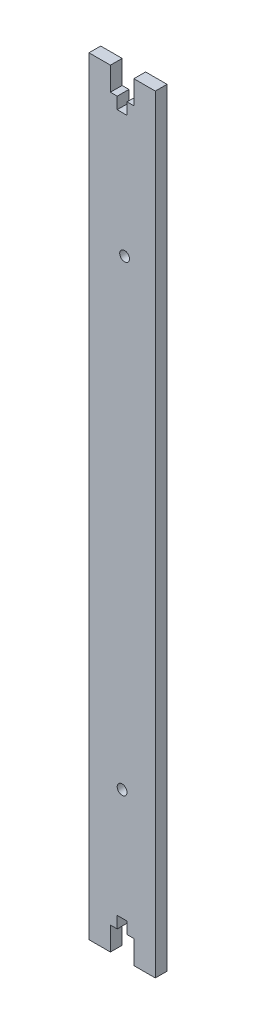
ISO-10303-21;
HEADER;
FILE_DESCRIPTION(('STEP AP214'),'2;1');
FILE_NAME('part.step','',(''),(''),'','','');
FILE_SCHEMA(('AUTOMOTIVE_DESIGN { 1 0 10303 214 1 1 1 1 }'));
ENDSEC;
DATA;
#1=APPLICATION_CONTEXT('core data for automotive mechanical design processes');
#2=APPLICATION_PROTOCOL_DEFINITION('international standard','automotive_design',2000,#1);
#3=PRODUCT_CONTEXT('',#1,'mechanical');
#4=PRODUCT('Part','Part','',(#3));
#5=PRODUCT_RELATED_PRODUCT_CATEGORY('part','',(#4));
#6=PRODUCT_DEFINITION_FORMATION('','',#4);
#7=PRODUCT_DEFINITION_CONTEXT('part definition',#1,'design');
#8=PRODUCT_DEFINITION('design','',#6,#7);
#9=PRODUCT_DEFINITION_SHAPE('','',#8);
#10=(LENGTH_UNIT() NAMED_UNIT(*) SI_UNIT(.MILLI.,.METRE.));
#11=(NAMED_UNIT(*) PLANE_ANGLE_UNIT() SI_UNIT($,.RADIAN.));
#12=(NAMED_UNIT(*) SI_UNIT($,.STERADIAN.) SOLID_ANGLE_UNIT());
#13=UNCERTAINTY_MEASURE_WITH_UNIT(LENGTH_MEASURE(1.E-05),#10,'distance_accuracy_value','');
#14=(GEOMETRIC_REPRESENTATION_CONTEXT(3) GLOBAL_UNCERTAINTY_ASSIGNED_CONTEXT((#13)) GLOBAL_UNIT_ASSIGNED_CONTEXT((#10,
#11,#12)) REPRESENTATION_CONTEXT('',''));
#15=CARTESIAN_POINT('',(0.,0.,0.));
#16=DIRECTION('',(0.,0.,1.));
#17=DIRECTION('',(1.,0.,0.));
#18=AXIS2_PLACEMENT_3D('',#15,#16,#17);
#19=CARTESIAN_POINT('',(-14.14,163.75,5.));
#20=DIRECTION('',(0.,-1.,0.));
#21=DIRECTION('',(0.,0.,-1.));
#22=AXIS2_PLACEMENT_3D('',#19,#20,#21);
#23=PLANE('',#22);
#24=DIRECTION('',(-1.,0.,0.));
#25=VECTOR('',#24,1.);
#26=CARTESIAN_POINT('',(-14.14,163.75,0.));
#27=LINE('',#26,#25);
#28=CARTESIAN_POINT('',(14.14,163.75,0.));
#29=VERTEX_POINT('',#28);
#30=CARTESIAN_POINT('',(5.,163.75,0.));
#31=VERTEX_POINT('',#30);
#32=EDGE_CURVE('E217',#29,#31,#27,.T.);
#33=ORIENTED_EDGE('',*,*,#32,.T.);
#34=DIRECTION('',(0.,0.,1.));
#35=VECTOR('',#34,1.);
#36=CARTESIAN_POINT('',(5.,163.75,-5.));
#37=LINE('',#36,#35);
#38=CARTESIAN_POINT('',(5.,163.75,5.));
#39=VERTEX_POINT('',#38);
#40=EDGE_CURVE('E237',#31,#39,#37,.T.);
#41=ORIENTED_EDGE('',*,*,#40,.T.);
#42=DIRECTION('',(-1.,0.,0.));
#43=VECTOR('',#42,1.);
#44=CARTESIAN_POINT('',(-14.14,163.75,5.));
#45=LINE('',#44,#43);
#46=CARTESIAN_POINT('',(14.14,163.75,5.));
#47=VERTEX_POINT('',#46);
#48=EDGE_CURVE('E196',#47,#39,#45,.T.);
#49=ORIENTED_EDGE('',*,*,#48,.F.);
#50=DIRECTION('',(0.,0.,-1.));
#51=VECTOR('',#50,1.);
#52=CARTESIAN_POINT('',(14.14,163.75,5.));
#53=LINE('',#52,#51);
#54=EDGE_CURVE('E231',#47,#29,#53,.T.);
#55=ORIENTED_EDGE('',*,*,#54,.T.);
#56=EDGE_LOOP('',(#33,#41,#49,#55));
#57=FACE_BOUND('',#56,.T.);
#58=ADVANCED_FACE('F33',(#57),#23,.F.);
#59=CARTESIAN_POINT('',(-14.14,-163.75,5.));
#60=DIRECTION('',(0.,1.,0.));
#61=DIRECTION('',(0.,0.,1.));
#62=AXIS2_PLACEMENT_3D('',#59,#60,#61);
#63=PLANE('',#62);
#64=DIRECTION('',(1.,0.,0.));
#65=VECTOR('',#64,1.);
#66=CARTESIAN_POINT('',(-14.14,-163.75,5.));
#67=LINE('',#66,#65);
#68=CARTESIAN_POINT('',(5.,-163.75,5.));
#69=VERTEX_POINT('',#68);
#70=CARTESIAN_POINT('',(14.14,-163.75,5.));
#71=VERTEX_POINT('',#70);
#72=EDGE_CURVE('E207',#69,#71,#67,.T.);
#73=ORIENTED_EDGE('',*,*,#72,.F.);
#74=DIRECTION('',(0.,0.,1.));
#75=VECTOR('',#74,1.);
#76=CARTESIAN_POINT('',(5.,-163.75,-5.));
#77=LINE('',#76,#75);
#78=CARTESIAN_POINT('',(5.,-163.75,0.));
#79=VERTEX_POINT('',#78);
#80=EDGE_CURVE('E324',#79,#69,#77,.T.);
#81=ORIENTED_EDGE('',*,*,#80,.F.);
#82=DIRECTION('',(1.,0.,0.));
#83=VECTOR('',#82,1.);
#84=CARTESIAN_POINT('',(-14.14,-163.75,0.));
#85=LINE('',#84,#83);
#86=CARTESIAN_POINT('',(14.14,-163.75,0.));
#87=VERTEX_POINT('',#86);
#88=EDGE_CURVE('E222',#79,#87,#85,.T.);
#89=ORIENTED_EDGE('',*,*,#88,.T.);
#90=DIRECTION('',(0.,0.,-1.));
#91=VECTOR('',#90,1.);
#92=CARTESIAN_POINT('',(14.14,-163.75,5.));
#93=LINE('',#92,#91);
#94=EDGE_CURVE('E211',#71,#87,#93,.T.);
#95=ORIENTED_EDGE('',*,*,#94,.F.);
#96=EDGE_LOOP('',(#73,#81,#89,#95));
#97=FACE_BOUND('',#96,.T.);
#98=ADVANCED_FACE('F369',(#97),#63,.F.);
#99=CARTESIAN_POINT('',(14.14,163.75,5.));
#100=DIRECTION('',(-1.,0.,0.));
#101=DIRECTION('',(0.,-1.,0.));
#102=AXIS2_PLACEMENT_3D('',#99,#100,#101);
#103=PLANE('',#102);
#104=DIRECTION('',(0.,1.,0.));
#105=VECTOR('',#104,1.);
#106=CARTESIAN_POINT('',(14.14,163.75,0.));
#107=LINE('',#106,#105);
#108=EDGE_CURVE('E212',#87,#29,#107,.T.);
#109=ORIENTED_EDGE('',*,*,#108,.T.);
#110=ORIENTED_EDGE('',*,*,#54,.F.);
#111=DIRECTION('',(0.,1.,0.));
#112=VECTOR('',#111,1.);
#113=CARTESIAN_POINT('',(14.14,163.75,5.));
#114=LINE('',#113,#112);
#115=EDGE_CURVE('E197',#71,#47,#114,.T.);
#116=ORIENTED_EDGE('',*,*,#115,.F.);
#117=ORIENTED_EDGE('',*,*,#94,.T.);
#118=EDGE_LOOP('',(#109,#110,#116,#117));
#119=FACE_BOUND('',#118,.T.);
#120=ADVANCED_FACE('F35',(#119),#103,.F.);
#121=CARTESIAN_POINT('',(-5.00000000000003,163.75,5.));
#122=VERTEX_POINT('',#121);
#123=CARTESIAN_POINT('',(-14.14,163.75,5.));
#124=VERTEX_POINT('',#123);
#125=EDGE_CURVE('E185',#122,#124,#45,.T.);
#126=ORIENTED_EDGE('',*,*,#125,.F.);
#127=DIRECTION('',(0.,0.,1.));
#128=VECTOR('',#127,1.);
#129=CARTESIAN_POINT('',(-5.00000000000003,163.75,-5.));
#130=LINE('',#129,#128);
#131=CARTESIAN_POINT('',(-5.00000000000003,163.75,0.));
#132=VERTEX_POINT('',#131);
#133=EDGE_CURVE('E169',#132,#122,#130,.T.);
#134=ORIENTED_EDGE('',*,*,#133,.F.);
#135=CARTESIAN_POINT('',(-14.14,163.75,0.));
#136=VERTEX_POINT('',#135);
#137=EDGE_CURVE('E215',#132,#136,#27,.T.);
#138=ORIENTED_EDGE('',*,*,#137,.T.);
#139=DIRECTION('',(0.,0.,-1.));
#140=VECTOR('',#139,1.);
#141=CARTESIAN_POINT('',(-14.14,163.75,5.));
#142=LINE('',#141,#140);
#143=EDGE_CURVE('E194',#124,#136,#142,.T.);
#144=ORIENTED_EDGE('',*,*,#143,.F.);
#145=EDGE_LOOP('',(#126,#134,#138,#144));
#146=FACE_BOUND('',#145,.T.);
#147=ADVANCED_FACE('F192',(#146),#23,.F.);
#148=CARTESIAN_POINT('',(-14.14,163.75,5.));
#149=DIRECTION('',(1.,0.,0.));
#150=DIRECTION('',(0.,1.,0.));
#151=AXIS2_PLACEMENT_3D('',#148,#149,#150);
#152=PLANE('',#151);
#153=DIRECTION('',(0.,-1.,0.));
#154=VECTOR('',#153,1.);
#155=CARTESIAN_POINT('',(-14.14,163.75,0.));
#156=LINE('',#155,#154);
#157=CARTESIAN_POINT('',(-14.14,-163.75,0.));
#158=VERTEX_POINT('',#157);
#159=EDGE_CURVE('E220',#136,#158,#156,.T.);
#160=ORIENTED_EDGE('',*,*,#159,.T.);
#161=DIRECTION('',(0.,0.,-1.));
#162=VECTOR('',#161,1.);
#163=CARTESIAN_POINT('',(-14.14,-163.75,5.));
#164=LINE('',#163,#162);
#165=CARTESIAN_POINT('',(-14.14,-163.75,5.));
#166=VERTEX_POINT('',#165);
#167=EDGE_CURVE('E227',#166,#158,#164,.T.);
#168=ORIENTED_EDGE('',*,*,#167,.F.);
#169=DIRECTION('',(0.,-1.,0.));
#170=VECTOR('',#169,1.);
#171=CARTESIAN_POINT('',(-14.14,163.75,5.));
#172=LINE('',#171,#170);
#173=EDGE_CURVE('E200',#124,#166,#172,.T.);
#174=ORIENTED_EDGE('',*,*,#173,.F.);
#175=ORIENTED_EDGE('',*,*,#143,.T.);
#176=EDGE_LOOP('',(#160,#168,#174,#175));
#177=FACE_BOUND('',#176,.T.);
#178=ADVANCED_FACE('F400',(#177),#152,.F.);
#179=CARTESIAN_POINT('',(-5.00000000000003,-163.75,0.));
#180=VERTEX_POINT('',#179);
#181=EDGE_CURVE('E202',#158,#180,#85,.T.);
#182=ORIENTED_EDGE('',*,*,#181,.T.);
#183=DIRECTION('',(0.,0.,1.));
#184=VECTOR('',#183,1.);
#185=CARTESIAN_POINT('',(-5.00000000000003,-163.75,-5.));
#186=LINE('',#185,#184);
#187=CARTESIAN_POINT('',(-5.00000000000003,-163.75,5.));
#188=VERTEX_POINT('',#187);
#189=EDGE_CURVE('E326',#180,#188,#186,.T.);
#190=ORIENTED_EDGE('',*,*,#189,.T.);
#191=EDGE_CURVE('E208',#166,#188,#67,.T.);
#192=ORIENTED_EDGE('',*,*,#191,.F.);
#193=ORIENTED_EDGE('',*,*,#167,.T.);
#194=EDGE_LOOP('',(#182,#190,#192,#193));
#195=FACE_BOUND('',#194,.T.);
#196=ADVANCED_FACE('F397',(#195),#63,.F.);
#197=CARTESIAN_POINT('',(0.,0.,5.));
#198=DIRECTION('',(0.,0.,1.));
#199=DIRECTION('',(1.,0.,0.));
#200=AXIS2_PLACEMENT_3D('',#197,#198,#199);
#201=PLANE('',#200);
#202=CARTESIAN_POINT('',(-0.00213562373089018,-101.25,5.));
#203=DIRECTION('',(0.,0.,1.));
#204=DIRECTION('',(1.,0.,0.));
#205=AXIS2_PLACEMENT_3D('',#202,#203,#204);
#206=CIRCLE('',#205,2.1);
#207=CARTESIAN_POINT('',(2.09786437626911,-101.25,5.));
#208=VERTEX_POINT('',#207);
#209=EDGE_CURVE('E338',#208,#208,#206,.T.);
#210=ORIENTED_EDGE('',*,*,#209,.F.);
#211=EDGE_LOOP('',(#210));
#212=FACE_BOUND('',#211,.T.);
#213=DIRECTION('',(0.,1.,0.));
#214=VECTOR('',#213,1.);
#215=CARTESIAN_POINT('',(5.,163.75,5.));
#216=LINE('',#215,#214);
#217=CARTESIAN_POINT('',(5.,153.75,5.));
#218=VERTEX_POINT('',#217);
#219=EDGE_CURVE('E179',#218,#39,#216,.T.);
#220=ORIENTED_EDGE('',*,*,#219,.F.);
#221=DIRECTION('',(1.,0.,0.));
#222=VECTOR('',#221,1.);
#223=CARTESIAN_POINT('',(5.,153.75,5.));
#224=LINE('',#223,#222);
#225=CARTESIAN_POINT('',(2.1,153.75,5.));
#226=VERTEX_POINT('',#225);
#227=EDGE_CURVE('E354',#226,#218,#224,.T.);
#228=ORIENTED_EDGE('',*,*,#227,.F.);
#229=DIRECTION('',(0.,1.,0.));
#230=VECTOR('',#229,1.);
#231=CARTESIAN_POINT('',(2.1,153.75,5.));
#232=LINE('',#231,#230);
#233=CARTESIAN_POINT('',(2.1,148.75,5.));
#234=VERTEX_POINT('',#233);
#235=EDGE_CURVE('E287',#234,#226,#232,.T.);
#236=ORIENTED_EDGE('',*,*,#235,.F.);
#237=DIRECTION('',(1.,0.,0.));
#238=VECTOR('',#237,1.);
#239=CARTESIAN_POINT('',(2.1,148.75,5.));
#240=LINE('',#239,#238);
#241=CARTESIAN_POINT('',(-2.10000000000001,148.75,5.));
#242=VERTEX_POINT('',#241);
#243=EDGE_CURVE('E350',#242,#234,#240,.T.);
#244=ORIENTED_EDGE('',*,*,#243,.F.);
#245=DIRECTION('',(0.,-1.,0.));
#246=VECTOR('',#245,1.);
#247=CARTESIAN_POINT('',(-2.10000000000001,153.75,5.));
#248=LINE('',#247,#246);
#249=CARTESIAN_POINT('',(-2.10000000000001,153.75,5.));
#250=VERTEX_POINT('',#249);
#251=EDGE_CURVE('E347',#250,#242,#248,.T.);
#252=ORIENTED_EDGE('',*,*,#251,.F.);
#253=DIRECTION('',(1.,0.,0.));
#254=VECTOR('',#253,1.);
#255=CARTESIAN_POINT('',(-5.00000000000002,153.75,5.));
#256=LINE('',#255,#254);
#257=CARTESIAN_POINT('',(-5.00000000000002,153.75,5.));
#258=VERTEX_POINT('',#257);
#259=EDGE_CURVE('E189',#258,#250,#256,.T.);
#260=ORIENTED_EDGE('',*,*,#259,.F.);
#261=DIRECTION('',(0.,-1.,0.));
#262=VECTOR('',#261,1.);
#263=CARTESIAN_POINT('',(-5.00000000000003,163.75,5.));
#264=LINE('',#263,#262);
#265=EDGE_CURVE('E172',#122,#258,#264,.T.);
#266=ORIENTED_EDGE('',*,*,#265,.F.);
#267=ORIENTED_EDGE('',*,*,#125,.T.);
#268=ORIENTED_EDGE('',*,*,#173,.T.);
#269=ORIENTED_EDGE('',*,*,#191,.T.);
#270=DIRECTION('',(0.,-1.,0.));
#271=VECTOR('',#270,1.);
#272=CARTESIAN_POINT('',(-5.00000000000003,-163.75,5.));
#273=LINE('',#272,#271);
#274=CARTESIAN_POINT('',(-5.00000000000002,-153.75,5.));
#275=VERTEX_POINT('',#274);
#276=EDGE_CURVE('E312',#275,#188,#273,.T.);
#277=ORIENTED_EDGE('',*,*,#276,.F.);
#278=DIRECTION('',(-1.,0.,0.));
#279=VECTOR('',#278,1.);
#280=CARTESIAN_POINT('',(-5.00000000000002,-153.75,5.));
#281=LINE('',#280,#279);
#282=CARTESIAN_POINT('',(-2.10000000000001,-153.75,5.));
#283=VERTEX_POINT('',#282);
#284=EDGE_CURVE('E309',#283,#275,#281,.T.);
#285=ORIENTED_EDGE('',*,*,#284,.F.);
#286=DIRECTION('',(0.,-1.,0.));
#287=VECTOR('',#286,1.);
#288=CARTESIAN_POINT('',(-2.10000000000001,-153.75,5.));
#289=LINE('',#288,#287);
#290=CARTESIAN_POINT('',(-2.10000000000001,-148.75,5.));
#291=VERTEX_POINT('',#290);
#292=EDGE_CURVE('E306',#291,#283,#289,.T.);
#293=ORIENTED_EDGE('',*,*,#292,.F.);
#294=DIRECTION('',(-1.,0.,0.));
#295=VECTOR('',#294,1.);
#296=CARTESIAN_POINT('',(2.1,-148.75,5.));
#297=LINE('',#296,#295);
#298=CARTESIAN_POINT('',(2.1,-148.75,5.));
#299=VERTEX_POINT('',#298);
#300=EDGE_CURVE('E303',#299,#291,#297,.T.);
#301=ORIENTED_EDGE('',*,*,#300,.F.);
#302=DIRECTION('',(0.,1.,0.));
#303=VECTOR('',#302,1.);
#304=CARTESIAN_POINT('',(2.1,-153.75,5.));
#305=LINE('',#304,#303);
#306=CARTESIAN_POINT('',(2.1,-153.75,5.));
#307=VERTEX_POINT('',#306);
#308=EDGE_CURVE('E300',#307,#299,#305,.T.);
#309=ORIENTED_EDGE('',*,*,#308,.F.);
#310=DIRECTION('',(-1.,0.,0.));
#311=VECTOR('',#310,1.);
#312=CARTESIAN_POINT('',(5.,-153.75,5.));
#313=LINE('',#312,#311);
#314=CARTESIAN_POINT('',(5.,-153.75,5.));
#315=VERTEX_POINT('',#314);
#316=EDGE_CURVE('E317',#315,#307,#313,.T.);
#317=ORIENTED_EDGE('',*,*,#316,.F.);
#318=DIRECTION('',(0.,1.,0.));
#319=VECTOR('',#318,1.);
#320=CARTESIAN_POINT('',(5.,-163.75,5.));
#321=LINE('',#320,#319);
#322=EDGE_CURVE('E314',#69,#315,#321,.T.);
#323=ORIENTED_EDGE('',*,*,#322,.F.);
#324=ORIENTED_EDGE('',*,*,#72,.T.);
#325=ORIENTED_EDGE('',*,*,#115,.T.);
#326=ORIENTED_EDGE('',*,*,#48,.T.);
#327=EDGE_LOOP('',(#220,#228,#236,#244,#252,#260,#266,#267,#268,#269,#277,#285,#293,#301,#309,
#317,#323,#324,#325,#326));
#328=FACE_BOUND('',#327,.T.);
#329=CARTESIAN_POINT('',(1.0585245480489,96.25,5.));
#330=DIRECTION('',(0.,0.,1.));
#331=DIRECTION('',(1.,0.,0.));
#332=AXIS2_PLACEMENT_3D('',#329,#330,#331);
#333=CIRCLE('',#332,2.1);
#334=CARTESIAN_POINT('',(3.15852454804891,96.25,5.));
#335=VERTEX_POINT('',#334);
#336=EDGE_CURVE('E304',#335,#335,#333,.T.);
#337=ORIENTED_EDGE('',*,*,#336,.F.);
#338=EDGE_LOOP('',(#337));
#339=FACE_BOUND('',#338,.T.);
#340=ADVANCED_FACE('F183',(#212,#328,#339),#201,.T.);
#341=CARTESIAN_POINT('',(0.,0.,0.));
#342=DIRECTION('',(0.,0.,1.));
#343=DIRECTION('',(1.,0.,0.));
#344=AXIS2_PLACEMENT_3D('',#341,#342,#343);
#345=PLANE('',#344);
#346=CARTESIAN_POINT('',(-0.00213562373089018,-101.25,0.));
#347=DIRECTION('',(0.,0.,1.));
#348=DIRECTION('',(1.,0.,0.));
#349=AXIS2_PLACEMENT_3D('',#346,#347,#348);
#350=CIRCLE('',#349,2.1);
#351=CARTESIAN_POINT('',(2.09786437626911,-101.25,0.));
#352=VERTEX_POINT('',#351);
#353=EDGE_CURVE('E37',#352,#352,#350,.T.);
#354=ORIENTED_EDGE('',*,*,#353,.T.);
#355=EDGE_LOOP('',(#354));
#356=FACE_BOUND('',#355,.T.);
#357=DIRECTION('',(1.,0.,0.));
#358=VECTOR('',#357,1.);
#359=CARTESIAN_POINT('',(0.,153.75,0.));
#360=LINE('',#359,#358);
#361=CARTESIAN_POINT('',(2.1,153.75,0.));
#362=VERTEX_POINT('',#361);
#363=CARTESIAN_POINT('',(5.,153.75,0.));
#364=VERTEX_POINT('',#363);
#365=EDGE_CURVE('E42',#362,#364,#360,.T.);
#366=ORIENTED_EDGE('',*,*,#365,.T.);
#367=DIRECTION('',(0.,1.,0.));
#368=VECTOR('',#367,1.);
#369=CARTESIAN_POINT('',(5.00000000000003,0.,0.));
#370=LINE('',#369,#368);
#371=EDGE_CURVE('E11',#364,#31,#370,.T.);
#372=ORIENTED_EDGE('',*,*,#371,.T.);
#373=ORIENTED_EDGE('',*,*,#32,.F.);
#374=ORIENTED_EDGE('',*,*,#108,.F.);
#375=ORIENTED_EDGE('',*,*,#88,.F.);
#376=DIRECTION('',(0.,1.,0.));
#377=VECTOR('',#376,1.);
#378=CARTESIAN_POINT('',(5.00000000000003,0.,0.));
#379=LINE('',#378,#377);
#380=CARTESIAN_POINT('',(5.,-153.75,0.));
#381=VERTEX_POINT('',#380);
#382=EDGE_CURVE('E255',#79,#381,#379,.T.);
#383=ORIENTED_EDGE('',*,*,#382,.T.);
#384=DIRECTION('',(-1.,0.,0.));
#385=VECTOR('',#384,1.);
#386=CARTESIAN_POINT('',(0.,-153.75,0.));
#387=LINE('',#386,#385);
#388=CARTESIAN_POINT('',(2.1,-153.75,0.));
#389=VERTEX_POINT('',#388);
#390=EDGE_CURVE('E252',#381,#389,#387,.T.);
#391=ORIENTED_EDGE('',*,*,#390,.T.);
#392=DIRECTION('',(0.,1.,0.));
#393=VECTOR('',#392,1.);
#394=CARTESIAN_POINT('',(2.1,0.,0.));
#395=LINE('',#394,#393);
#396=CARTESIAN_POINT('',(2.1,-148.75,0.));
#397=VERTEX_POINT('',#396);
#398=EDGE_CURVE('E249',#389,#397,#395,.T.);
#399=ORIENTED_EDGE('',*,*,#398,.T.);
#400=DIRECTION('',(-1.,0.,0.));
#401=VECTOR('',#400,1.);
#402=CARTESIAN_POINT('',(0.,-148.75,0.));
#403=LINE('',#402,#401);
#404=CARTESIAN_POINT('',(-2.10000000000001,-148.75,0.));
#405=VERTEX_POINT('',#404);
#406=EDGE_CURVE('E234',#397,#405,#403,.T.);
#407=ORIENTED_EDGE('',*,*,#406,.T.);
#408=DIRECTION('',(0.,-1.,0.));
#409=VECTOR('',#408,1.);
#410=CARTESIAN_POINT('',(-2.09999999999975,0.,0.));
#411=LINE('',#410,#409);
#412=CARTESIAN_POINT('',(-2.10000000000001,-153.75,0.));
#413=VERTEX_POINT('',#412);
#414=EDGE_CURVE('E240',#405,#413,#411,.T.);
#415=ORIENTED_EDGE('',*,*,#414,.T.);
#416=DIRECTION('',(-1.,0.,0.));
#417=VECTOR('',#416,1.);
#418=CARTESIAN_POINT('',(0.,-153.75,0.));
#419=LINE('',#418,#417);
#420=CARTESIAN_POINT('',(-5.00000000000002,-153.75,0.));
#421=VERTEX_POINT('',#420);
#422=EDGE_CURVE('E243',#413,#421,#419,.T.);
#423=ORIENTED_EDGE('',*,*,#422,.T.);
#424=DIRECTION('',(0.,-1.,0.));
#425=VECTOR('',#424,1.);
#426=CARTESIAN_POINT('',(-4.99999999999977,0.,0.));
#427=LINE('',#426,#425);
#428=EDGE_CURVE('E246',#421,#180,#427,.T.);
#429=ORIENTED_EDGE('',*,*,#428,.T.);
#430=ORIENTED_EDGE('',*,*,#181,.F.);
#431=ORIENTED_EDGE('',*,*,#159,.F.);
#432=ORIENTED_EDGE('',*,*,#137,.F.);
#433=DIRECTION('',(0.,-1.,0.));
#434=VECTOR('',#433,1.);
#435=CARTESIAN_POINT('',(-4.99999999999977,0.,0.));
#436=LINE('',#435,#434);
#437=CARTESIAN_POINT('',(-5.00000000000002,153.75,0.));
#438=VERTEX_POINT('',#437);
#439=EDGE_CURVE('E175',#132,#438,#436,.T.);
#440=ORIENTED_EDGE('',*,*,#439,.T.);
#441=DIRECTION('',(1.,0.,0.));
#442=VECTOR('',#441,1.);
#443=CARTESIAN_POINT('',(0.,153.75,0.));
#444=LINE('',#443,#442);
#445=CARTESIAN_POINT('',(-2.10000000000001,153.75,0.));
#446=VERTEX_POINT('',#445);
#447=EDGE_CURVE('E259',#438,#446,#444,.T.);
#448=ORIENTED_EDGE('',*,*,#447,.T.);
#449=DIRECTION('',(0.,-1.,0.));
#450=VECTOR('',#449,1.);
#451=CARTESIAN_POINT('',(-2.09999999999975,0.,0.));
#452=LINE('',#451,#450);
#453=CARTESIAN_POINT('',(-2.10000000000001,148.75,0.));
#454=VERTEX_POINT('',#453);
#455=EDGE_CURVE('E262',#446,#454,#452,.T.);
#456=ORIENTED_EDGE('',*,*,#455,.T.);
#457=DIRECTION('',(1.,0.,0.));
#458=VECTOR('',#457,1.);
#459=CARTESIAN_POINT('',(0.,148.75,0.));
#460=LINE('',#459,#458);
#461=CARTESIAN_POINT('',(2.1,148.75,0.));
#462=VERTEX_POINT('',#461);
#463=EDGE_CURVE('E265',#454,#462,#460,.T.);
#464=ORIENTED_EDGE('',*,*,#463,.T.);
#465=DIRECTION('',(0.,1.,0.));
#466=VECTOR('',#465,1.);
#467=CARTESIAN_POINT('',(2.1,0.,0.));
#468=LINE('',#467,#466);
#469=EDGE_CURVE('E268',#462,#362,#468,.T.);
#470=ORIENTED_EDGE('',*,*,#469,.T.);
#471=EDGE_LOOP('',(#366,#372,#373,#374,#375,#383,#391,#399,#407,#415,#423,#429,#430,#431,#432,
#440,#448,#456,#464,#470));
#472=FACE_BOUND('',#471,.T.);
#473=CARTESIAN_POINT('',(1.0585245480489,96.25,0.));
#474=DIRECTION('',(0.,0.,1.));
#475=DIRECTION('',(1.,0.,0.));
#476=AXIS2_PLACEMENT_3D('',#473,#474,#475);
#477=CIRCLE('',#476,2.1);
#478=CARTESIAN_POINT('',(3.15852454804891,96.25,0.));
#479=VERTEX_POINT('',#478);
#480=EDGE_CURVE('E216',#479,#479,#477,.T.);
#481=ORIENTED_EDGE('',*,*,#480,.T.);
#482=EDGE_LOOP('',(#481));
#483=FACE_BOUND('',#482,.T.);
#484=ADVANCED_FACE('F273',(#356,#472,#483),#345,.F.);
#485=CARTESIAN_POINT('',(1.0585245480489,96.25,-5.));
#486=DIRECTION('',(0.,0.,1.));
#487=DIRECTION('',(1.,0.,0.));
#488=AXIS2_PLACEMENT_3D('',#485,#486,#487);
#489=CYLINDRICAL_SURFACE('',#488,2.1);
#490=ORIENTED_EDGE('',*,*,#336,.T.);
#491=EDGE_LOOP('',(#490));
#492=FACE_BOUND('',#491,.T.);
#493=ORIENTED_EDGE('',*,*,#480,.F.);
#494=EDGE_LOOP('',(#493));
#495=FACE_BOUND('',#494,.T.);
#496=ADVANCED_FACE('F459',(#492,#495),#489,.F.);
#497=CARTESIAN_POINT('',(2.1,-153.75,-5.));
#498=DIRECTION('',(1.,0.,0.));
#499=DIRECTION('',(0.,0.,-1.));
#500=AXIS2_PLACEMENT_3D('',#497,#498,#499);
#501=PLANE('',#500);
#502=DIRECTION('',(0.,0.,1.));
#503=VECTOR('',#502,1.);
#504=CARTESIAN_POINT('',(2.1,-153.75,-5.));
#505=LINE('',#504,#503);
#506=EDGE_CURVE('E190',#389,#307,#505,.T.);
#507=ORIENTED_EDGE('',*,*,#506,.T.);
#508=ORIENTED_EDGE('',*,*,#308,.T.);
#509=DIRECTION('',(0.,0.,1.));
#510=VECTOR('',#509,1.);
#511=CARTESIAN_POINT('',(2.1,-148.75,-5.));
#512=LINE('',#511,#510);
#513=EDGE_CURVE('E320',#397,#299,#512,.T.);
#514=ORIENTED_EDGE('',*,*,#513,.F.);
#515=ORIENTED_EDGE('',*,*,#398,.F.);
#516=EDGE_LOOP('',(#507,#508,#514,#515));
#517=FACE_BOUND('',#516,.T.);
#518=ADVANCED_FACE('F381',(#517),#501,.F.);
#519=CARTESIAN_POINT('',(5.,-153.75,-5.));
#520=DIRECTION('',(0.,1.,0.));
#521=DIRECTION('',(0.,0.,1.));
#522=AXIS2_PLACEMENT_3D('',#519,#520,#521);
#523=PLANE('',#522);
#524=DIRECTION('',(0.,0.,1.));
#525=VECTOR('',#524,1.);
#526=CARTESIAN_POINT('',(5.,-153.75,-5.));
#527=LINE('',#526,#525);
#528=EDGE_CURVE('E322',#381,#315,#527,.T.);
#529=ORIENTED_EDGE('',*,*,#528,.T.);
#530=ORIENTED_EDGE('',*,*,#316,.T.);
#531=ORIENTED_EDGE('',*,*,#506,.F.);
#532=ORIENTED_EDGE('',*,*,#390,.F.);
#533=EDGE_LOOP('',(#529,#530,#531,#532));
#534=FACE_BOUND('',#533,.T.);
#535=ADVANCED_FACE('F378',(#534),#523,.F.);
#536=CARTESIAN_POINT('',(5.,-163.75,-5.));
#537=DIRECTION('',(1.,0.,0.));
#538=DIRECTION('',(0.,1.,0.));
#539=AXIS2_PLACEMENT_3D('',#536,#537,#538);
#540=PLANE('',#539);
#541=ORIENTED_EDGE('',*,*,#80,.T.);
#542=ORIENTED_EDGE('',*,*,#322,.T.);
#543=ORIENTED_EDGE('',*,*,#528,.F.);
#544=ORIENTED_EDGE('',*,*,#382,.F.);
#545=EDGE_LOOP('',(#541,#542,#543,#544));
#546=FACE_BOUND('',#545,.T.);
#547=ADVANCED_FACE('F371',(#546),#540,.F.);
#548=CARTESIAN_POINT('',(-5.00000000000003,-163.75,-5.));
#549=DIRECTION('',(-1.,0.,0.));
#550=DIRECTION('',(0.,-1.,0.));
#551=AXIS2_PLACEMENT_3D('',#548,#549,#550);
#552=PLANE('',#551);
#553=DIRECTION('',(0.,0.,1.));
#554=VECTOR('',#553,1.);
#555=CARTESIAN_POINT('',(-5.00000000000002,-153.75,-5.));
#556=LINE('',#555,#554);
#557=EDGE_CURVE('E329',#421,#275,#556,.T.);
#558=ORIENTED_EDGE('',*,*,#557,.T.);
#559=ORIENTED_EDGE('',*,*,#276,.T.);
#560=ORIENTED_EDGE('',*,*,#189,.F.);
#561=ORIENTED_EDGE('',*,*,#428,.F.);
#562=EDGE_LOOP('',(#558,#559,#560,#561));
#563=FACE_BOUND('',#562,.T.);
#564=ADVANCED_FACE('F394',(#563),#552,.F.);
#565=CARTESIAN_POINT('',(-5.00000000000002,-153.75,-5.));
#566=DIRECTION('',(0.,1.,0.));
#567=DIRECTION('',(0.,0.,1.));
#568=AXIS2_PLACEMENT_3D('',#565,#566,#567);
#569=PLANE('',#568);
#570=DIRECTION('',(0.,0.,1.));
#571=VECTOR('',#570,1.);
#572=CARTESIAN_POINT('',(-2.10000000000001,-153.75,-5.));
#573=LINE('',#572,#571);
#574=EDGE_CURVE('E331',#413,#283,#573,.T.);
#575=ORIENTED_EDGE('',*,*,#574,.T.);
#576=ORIENTED_EDGE('',*,*,#284,.T.);
#577=ORIENTED_EDGE('',*,*,#557,.F.);
#578=ORIENTED_EDGE('',*,*,#422,.F.);
#579=EDGE_LOOP('',(#575,#576,#577,#578));
#580=FACE_BOUND('',#579,.T.);
#581=ADVANCED_FACE('F392',(#580),#569,.F.);
#582=CARTESIAN_POINT('',(-2.10000000000001,-153.75,-5.));
#583=DIRECTION('',(-1.,0.,0.));
#584=DIRECTION('',(0.,-1.,0.));
#585=AXIS2_PLACEMENT_3D('',#582,#583,#584);
#586=PLANE('',#585);
#587=DIRECTION('',(0.,0.,1.));
#588=VECTOR('',#587,1.);
#589=CARTESIAN_POINT('',(-2.10000000000001,-148.75,-5.));
#590=LINE('',#589,#588);
#591=EDGE_CURVE('E57',#405,#291,#590,.T.);
#592=ORIENTED_EDGE('',*,*,#591,.T.);
#593=ORIENTED_EDGE('',*,*,#292,.T.);
#594=ORIENTED_EDGE('',*,*,#574,.F.);
#595=ORIENTED_EDGE('',*,*,#414,.F.);
#596=EDGE_LOOP('',(#592,#593,#594,#595));
#597=FACE_BOUND('',#596,.T.);
#598=ADVANCED_FACE('F388',(#597),#586,.F.);
#599=CARTESIAN_POINT('',(2.1,-148.75,-5.));
#600=DIRECTION('',(0.,1.,0.));
#601=DIRECTION('',(0.,0.,1.));
#602=AXIS2_PLACEMENT_3D('',#599,#600,#601);
#603=PLANE('',#602);
#604=ORIENTED_EDGE('',*,*,#513,.T.);
#605=ORIENTED_EDGE('',*,*,#300,.T.);
#606=ORIENTED_EDGE('',*,*,#591,.F.);
#607=ORIENTED_EDGE('',*,*,#406,.F.);
#608=EDGE_LOOP('',(#604,#605,#606,#607));
#609=FACE_BOUND('',#608,.T.);
#610=ADVANCED_FACE('F382',(#609),#603,.F.);
#611=CARTESIAN_POINT('',(5.,163.75,-5.));
#612=DIRECTION('',(1.,0.,0.));
#613=DIRECTION('',(0.,1.,0.));
#614=AXIS2_PLACEMENT_3D('',#611,#612,#613);
#615=PLANE('',#614);
#616=DIRECTION('',(0.,0.,1.));
#617=VECTOR('',#616,1.);
#618=CARTESIAN_POINT('',(5.,153.75,-5.));
#619=LINE('',#618,#617);
#620=EDGE_CURVE('E282',#364,#218,#619,.T.);
#621=ORIENTED_EDGE('',*,*,#620,.T.);
#622=ORIENTED_EDGE('',*,*,#219,.T.);
#623=ORIENTED_EDGE('',*,*,#40,.F.);
#624=ORIENTED_EDGE('',*,*,#371,.F.);
#625=EDGE_LOOP('',(#621,#622,#623,#624));
#626=FACE_BOUND('',#625,.T.);
#627=ADVANCED_FACE('F521',(#626),#615,.F.);
#628=CARTESIAN_POINT('',(5.,153.75,-5.));
#629=DIRECTION('',(0.,-1.,0.));
#630=DIRECTION('',(0.,0.,-1.));
#631=AXIS2_PLACEMENT_3D('',#628,#629,#630);
#632=PLANE('',#631);
#633=DIRECTION('',(0.,0.,1.));
#634=VECTOR('',#633,1.);
#635=CARTESIAN_POINT('',(2.1,153.75,-5.));
#636=LINE('',#635,#634);
#637=EDGE_CURVE('E280',#362,#226,#636,.T.);
#638=ORIENTED_EDGE('',*,*,#637,.T.);
#639=ORIENTED_EDGE('',*,*,#227,.T.);
#640=ORIENTED_EDGE('',*,*,#620,.F.);
#641=ORIENTED_EDGE('',*,*,#365,.F.);
#642=EDGE_LOOP('',(#638,#639,#640,#641));
#643=FACE_BOUND('',#642,.T.);
#644=ADVANCED_FACE('F278',(#643),#632,.F.);
#645=CARTESIAN_POINT('',(2.1,153.75,-5.));
#646=DIRECTION('',(1.,0.,0.));
#647=DIRECTION('',(0.,0.,-1.));
#648=AXIS2_PLACEMENT_3D('',#645,#646,#647);
#649=PLANE('',#648);
#650=DIRECTION('',(0.,0.,1.));
#651=VECTOR('',#650,1.);
#652=CARTESIAN_POINT('',(2.1,148.75,-5.));
#653=LINE('',#652,#651);
#654=EDGE_CURVE('E289',#462,#234,#653,.T.);
#655=ORIENTED_EDGE('',*,*,#654,.T.);
#656=ORIENTED_EDGE('',*,*,#235,.T.);
#657=ORIENTED_EDGE('',*,*,#637,.F.);
#658=ORIENTED_EDGE('',*,*,#469,.F.);
#659=EDGE_LOOP('',(#655,#656,#657,#658));
#660=FACE_BOUND('',#659,.T.);
#661=ADVANCED_FACE('F284',(#660),#649,.F.);
#662=CARTESIAN_POINT('',(2.1,148.75,-5.));
#663=DIRECTION('',(0.,-1.,0.));
#664=DIRECTION('',(0.,0.,-1.));
#665=AXIS2_PLACEMENT_3D('',#662,#663,#664);
#666=PLANE('',#665);
#667=DIRECTION('',(0.,0.,1.));
#668=VECTOR('',#667,1.);
#669=CARTESIAN_POINT('',(-2.10000000000001,148.75,-5.));
#670=LINE('',#669,#668);
#671=EDGE_CURVE('E292',#454,#242,#670,.T.);
#672=ORIENTED_EDGE('',*,*,#671,.T.);
#673=ORIENTED_EDGE('',*,*,#243,.T.);
#674=ORIENTED_EDGE('',*,*,#654,.F.);
#675=ORIENTED_EDGE('',*,*,#463,.F.);
#676=EDGE_LOOP('',(#672,#673,#674,#675));
#677=FACE_BOUND('',#676,.T.);
#678=ADVANCED_FACE('F410',(#677),#666,.F.);
#679=CARTESIAN_POINT('',(-2.10000000000001,153.75,-5.));
#680=DIRECTION('',(-1.,0.,0.));
#681=DIRECTION('',(0.,-1.,0.));
#682=AXIS2_PLACEMENT_3D('',#679,#680,#681);
#683=PLANE('',#682);
#684=DIRECTION('',(0.,0.,1.));
#685=VECTOR('',#684,1.);
#686=CARTESIAN_POINT('',(-2.10000000000001,153.75,-5.));
#687=LINE('',#686,#685);
#688=EDGE_CURVE('E297',#446,#250,#687,.T.);
#689=ORIENTED_EDGE('',*,*,#688,.T.);
#690=ORIENTED_EDGE('',*,*,#251,.T.);
#691=ORIENTED_EDGE('',*,*,#671,.F.);
#692=ORIENTED_EDGE('',*,*,#455,.F.);
#693=EDGE_LOOP('',(#689,#690,#691,#692));
#694=FACE_BOUND('',#693,.T.);
#695=ADVANCED_FACE('F406',(#694),#683,.F.);
#696=CARTESIAN_POINT('',(-5.00000000000002,153.75,-5.));
#697=DIRECTION('',(0.,-1.,0.));
#698=DIRECTION('',(0.,0.,-1.));
#699=AXIS2_PLACEMENT_3D('',#696,#697,#698);
#700=PLANE('',#699);
#701=DIRECTION('',(0.,0.,1.));
#702=VECTOR('',#701,1.);
#703=CARTESIAN_POINT('',(-5.00000000000002,153.75,-5.));
#704=LINE('',#703,#702);
#705=EDGE_CURVE('E49',#438,#258,#704,.T.);
#706=ORIENTED_EDGE('',*,*,#705,.T.);
#707=ORIENTED_EDGE('',*,*,#259,.T.);
#708=ORIENTED_EDGE('',*,*,#688,.F.);
#709=ORIENTED_EDGE('',*,*,#447,.F.);
#710=EDGE_LOOP('',(#706,#707,#708,#709));
#711=FACE_BOUND('',#710,.T.);
#712=ADVANCED_FACE('F404',(#711),#700,.F.);
#713=CARTESIAN_POINT('',(-5.00000000000003,163.75,-5.));
#714=DIRECTION('',(-1.,0.,0.));
#715=DIRECTION('',(0.,-1.,0.));
#716=AXIS2_PLACEMENT_3D('',#713,#714,#715);
#717=PLANE('',#716);
#718=ORIENTED_EDGE('',*,*,#133,.T.);
#719=ORIENTED_EDGE('',*,*,#265,.T.);
#720=ORIENTED_EDGE('',*,*,#705,.F.);
#721=ORIENTED_EDGE('',*,*,#439,.F.);
#722=EDGE_LOOP('',(#718,#719,#720,#721));
#723=FACE_BOUND('',#722,.T.);
#724=ADVANCED_FACE('F171',(#723),#717,.F.);
#725=CARTESIAN_POINT('',(-0.00213562373089018,-101.25,-5.));
#726=DIRECTION('',(0.,0.,1.));
#727=DIRECTION('',(1.,0.,0.));
#728=AXIS2_PLACEMENT_3D('',#725,#726,#727);
#729=CYLINDRICAL_SURFACE('',#728,2.1);
#730=ORIENTED_EDGE('',*,*,#209,.T.);
#731=EDGE_LOOP('',(#730));
#732=FACE_BOUND('',#731,.T.);
#733=ORIENTED_EDGE('',*,*,#353,.F.);
#734=EDGE_LOOP('',(#733));
#735=FACE_BOUND('',#734,.T.);
#736=ADVANCED_FACE('F570',(#732,#735),#729,.F.);
#737=CLOSED_SHELL('',(#58,#98,#120,#147,#178,#196,#340,#484,#496,#518,#535,#547,#564,#581,#598,
#610,#627,#644,#661,#678,#695,#712,#724,#736));
#738=MANIFOLD_SOLID_BREP('B2',#737);
#739=ADVANCED_BREP_SHAPE_REPRESENTATION('',(#18,#738),#14);
#740=SHAPE_DEFINITION_REPRESENTATION(#9,#739);
ENDSEC;
END-ISO-10303-21;
